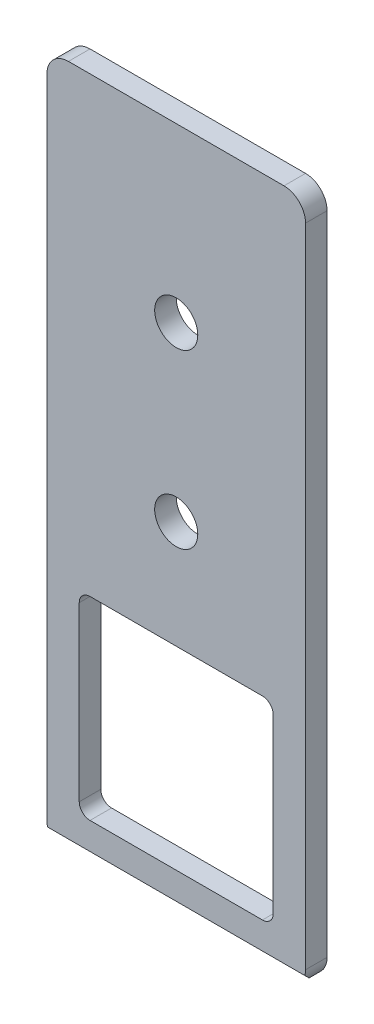
ISO-10303-21;
HEADER;
FILE_DESCRIPTION(('STEP AP214'),'2;1');
FILE_NAME('part.step','',(''),(''),'','','');
FILE_SCHEMA(('AUTOMOTIVE_DESIGN { 1 0 10303 214 1 1 1 1 }'));
ENDSEC;
DATA;
#1=APPLICATION_CONTEXT('core data for automotive mechanical design processes');
#2=APPLICATION_PROTOCOL_DEFINITION('international standard','automotive_design',2000,#1);
#3=PRODUCT_CONTEXT('',#1,'mechanical');
#4=PRODUCT('Part','Part','',(#3));
#5=PRODUCT_RELATED_PRODUCT_CATEGORY('part','',(#4));
#6=PRODUCT_DEFINITION_FORMATION('','',#4);
#7=PRODUCT_DEFINITION_CONTEXT('part definition',#1,'design');
#8=PRODUCT_DEFINITION('design','',#6,#7);
#9=PRODUCT_DEFINITION_SHAPE('','',#8);
#10=(LENGTH_UNIT() NAMED_UNIT(*) SI_UNIT(.MILLI.,.METRE.));
#11=(NAMED_UNIT(*) PLANE_ANGLE_UNIT() SI_UNIT($,.RADIAN.));
#12=(NAMED_UNIT(*) SI_UNIT($,.STERADIAN.) SOLID_ANGLE_UNIT());
#13=UNCERTAINTY_MEASURE_WITH_UNIT(LENGTH_MEASURE(1.E-05),#10,'distance_accuracy_value','');
#14=(GEOMETRIC_REPRESENTATION_CONTEXT(3) GLOBAL_UNCERTAINTY_ASSIGNED_CONTEXT((#13)) GLOBAL_UNIT_ASSIGNED_CONTEXT((#10,
#11,#12)) REPRESENTATION_CONTEXT('',''));
#15=CARTESIAN_POINT('',(0.,0.,0.));
#16=DIRECTION('',(0.,0.,1.));
#17=DIRECTION('',(1.,0.,0.));
#18=AXIS2_PLACEMENT_3D('',#15,#16,#17);
#19=CARTESIAN_POINT('',(3.175,98.425,3.175));
#20=DIRECTION('',(0.,0.,-1.));
#21=DIRECTION('',(-1.,0.,0.));
#22=AXIS2_PLACEMENT_3D('',#19,#20,#21);
#23=PLANE('',#22);
#24=CARTESIAN_POINT('',(19.05,76.2,3.175));
#25=DIRECTION('',(0.,0.,1.));
#26=DIRECTION('',(1.,0.,0.));
#27=AXIS2_PLACEMENT_3D('',#24,#25,#26);
#28=CIRCLE('',#27,3.175);
#29=CARTESIAN_POINT('',(22.225,76.2,3.175));
#30=VERTEX_POINT('',#29);
#31=EDGE_CURVE('E353',#30,#30,#28,.T.);
#32=ORIENTED_EDGE('',*,*,#31,.F.);
#33=EDGE_LOOP('',(#32));
#34=FACE_BOUND('',#33,.T.);
#35=CARTESIAN_POINT('',(19.05,50.8,3.175));
#36=DIRECTION('',(0.,0.,1.));
#37=DIRECTION('',(1.,0.,0.));
#38=AXIS2_PLACEMENT_3D('',#35,#36,#37);
#39=CIRCLE('',#38,3.175);
#40=CARTESIAN_POINT('',(22.225,50.8,3.175));
#41=VERTEX_POINT('',#40);
#42=EDGE_CURVE('E197',#41,#41,#39,.T.);
#43=ORIENTED_EDGE('',*,*,#42,.F.);
#44=EDGE_LOOP('',(#43));
#45=FACE_BOUND('',#44,.T.);
#46=CARTESIAN_POINT('',(3.175,3.175,3.175));
#47=DIRECTION('',(0.,0.,1.));
#48=DIRECTION('',(-1.,0.,0.));
#49=AXIS2_PLACEMENT_3D('',#46,#47,#48);
#50=CIRCLE('',#49,3.175);
#51=CARTESIAN_POINT('',(0.,3.17500000000002,3.175));
#52=VERTEX_POINT('',#51);
#53=CARTESIAN_POINT('',(0.100819468947863,2.38125,3.175));
#54=VERTEX_POINT('',#53);
#55=EDGE_CURVE('E168',#52,#54,#50,.T.);
#56=ORIENTED_EDGE('',*,*,#55,.T.);
#57=DIRECTION('',(-1.,0.,0.));
#58=VECTOR('',#57,1.);
#59=CARTESIAN_POINT('',(85.471,2.38125,3.175));
#60=LINE('',#59,#58);
#61=CARTESIAN_POINT('',(37.9991805310521,2.38125,3.175));
#62=VERTEX_POINT('',#61);
#63=EDGE_CURVE('E157',#62,#54,#60,.T.);
#64=ORIENTED_EDGE('',*,*,#63,.F.);
#65=CARTESIAN_POINT('',(34.925,3.175,3.175));
#66=DIRECTION('',(0.,0.,1.));
#67=DIRECTION('',(1.,0.,0.));
#68=AXIS2_PLACEMENT_3D('',#65,#66,#67);
#69=CIRCLE('',#68,3.175);
#70=CARTESIAN_POINT('',(38.1,3.175,3.175));
#71=VERTEX_POINT('',#70);
#72=EDGE_CURVE('E165',#62,#71,#69,.T.);
#73=ORIENTED_EDGE('',*,*,#72,.T.);
#74=DIRECTION('',(0.,1.,0.));
#75=VECTOR('',#74,1.);
#76=CARTESIAN_POINT('',(38.1,3.17500000000002,3.175));
#77=LINE('',#76,#75);
#78=CARTESIAN_POINT('',(38.1,98.425,3.175));
#79=VERTEX_POINT('',#78);
#80=EDGE_CURVE('E176',#71,#79,#77,.T.);
#81=ORIENTED_EDGE('',*,*,#80,.T.);
#82=CARTESIAN_POINT('',(34.925,98.425,3.175));
#83=DIRECTION('',(0.,0.,1.));
#84=DIRECTION('',(-1.,0.,0.));
#85=AXIS2_PLACEMENT_3D('',#82,#83,#84);
#86=CIRCLE('',#85,3.175);
#87=CARTESIAN_POINT('',(34.925,101.6,3.175));
#88=VERTEX_POINT('',#87);
#89=EDGE_CURVE('E180',#79,#88,#86,.T.);
#90=ORIENTED_EDGE('',*,*,#89,.T.);
#91=DIRECTION('',(-1.,0.,0.));
#92=VECTOR('',#91,1.);
#93=CARTESIAN_POINT('',(3.17500000000002,101.6,3.175));
#94=LINE('',#93,#92);
#95=CARTESIAN_POINT('',(3.17500000000002,101.6,3.175));
#96=VERTEX_POINT('',#95);
#97=EDGE_CURVE('E188',#88,#96,#94,.T.);
#98=ORIENTED_EDGE('',*,*,#97,.T.);
#99=CARTESIAN_POINT('',(3.175,98.425,3.175));
#100=DIRECTION('',(0.,0.,1.));
#101=DIRECTION('',(-1.,0.,0.));
#102=AXIS2_PLACEMENT_3D('',#99,#100,#101);
#103=CIRCLE('',#102,3.175);
#104=CARTESIAN_POINT('',(0.,98.425,3.175));
#105=VERTEX_POINT('',#104);
#106=EDGE_CURVE('E220',#96,#105,#103,.T.);
#107=ORIENTED_EDGE('',*,*,#106,.T.);
#108=DIRECTION('',(0.,-1.,0.));
#109=VECTOR('',#108,1.);
#110=CARTESIAN_POINT('',(0.,3.17500000000002,3.175));
#111=LINE('',#110,#109);
#112=EDGE_CURVE('E182',#105,#52,#111,.T.);
#113=ORIENTED_EDGE('',*,*,#112,.T.);
#114=EDGE_LOOP('',(#56,#64,#73,#81,#90,#98,#107,#113));
#115=FACE_BOUND('',#114,.T.);
#116=CARTESIAN_POINT('',(6.35,7.9375,3.175));
#117=DIRECTION('',(0.,0.,1.));
#118=DIRECTION('',(-1.,0.,0.));
#119=AXIS2_PLACEMENT_3D('',#116,#117,#118);
#120=CIRCLE('',#119,1.5875);
#121=CARTESIAN_POINT('',(4.7625,7.93750000000001,3.175));
#122=VERTEX_POINT('',#121);
#123=CARTESIAN_POINT('',(6.35000000000001,6.35,3.175));
#124=VERTEX_POINT('',#123);
#125=EDGE_CURVE('E276',#122,#124,#120,.T.);
#126=ORIENTED_EDGE('',*,*,#125,.F.);
#127=DIRECTION('',(0.,-1.,0.));
#128=VECTOR('',#127,1.);
#129=CARTESIAN_POINT('',(4.7625,7.93750000000001,3.175));
#130=LINE('',#129,#128);
#131=CARTESIAN_POINT('',(4.7625,33.3375,3.175));
#132=VERTEX_POINT('',#131);
#133=EDGE_CURVE('E298',#132,#122,#130,.T.);
#134=ORIENTED_EDGE('',*,*,#133,.F.);
#135=CARTESIAN_POINT('',(6.35,33.3375,3.175));
#136=DIRECTION('',(0.,0.,1.));
#137=DIRECTION('',(-1.,0.,0.));
#138=AXIS2_PLACEMENT_3D('',#135,#136,#137);
#139=CIRCLE('',#138,1.5875);
#140=CARTESIAN_POINT('',(6.35000000000001,34.925,3.175));
#141=VERTEX_POINT('',#140);
#142=EDGE_CURVE('E295',#141,#132,#139,.T.);
#143=ORIENTED_EDGE('',*,*,#142,.F.);
#144=DIRECTION('',(-1.,0.,0.));
#145=VECTOR('',#144,1.);
#146=CARTESIAN_POINT('',(6.35000000000001,34.925,3.175));
#147=LINE('',#146,#145);
#148=CARTESIAN_POINT('',(31.75,34.925,3.175));
#149=VERTEX_POINT('',#148);
#150=EDGE_CURVE('E292',#149,#141,#147,.T.);
#151=ORIENTED_EDGE('',*,*,#150,.F.);
#152=CARTESIAN_POINT('',(31.75,33.3375,3.175));
#153=DIRECTION('',(0.,0.,1.));
#154=DIRECTION('',(-1.,0.,0.));
#155=AXIS2_PLACEMENT_3D('',#152,#153,#154);
#156=CIRCLE('',#155,1.5875);
#157=CARTESIAN_POINT('',(33.3375,33.3375,3.175));
#158=VERTEX_POINT('',#157);
#159=EDGE_CURVE('E289',#158,#149,#156,.T.);
#160=ORIENTED_EDGE('',*,*,#159,.F.);
#161=DIRECTION('',(0.,1.,0.));
#162=VECTOR('',#161,1.);
#163=CARTESIAN_POINT('',(33.3375,7.93750000000001,3.175));
#164=LINE('',#163,#162);
#165=CARTESIAN_POINT('',(33.3375,7.9375,3.175));
#166=VERTEX_POINT('',#165);
#167=EDGE_CURVE('E286',#166,#158,#164,.T.);
#168=ORIENTED_EDGE('',*,*,#167,.F.);
#169=CARTESIAN_POINT('',(31.75,7.9375,3.175));
#170=DIRECTION('',(0.,0.,1.));
#171=DIRECTION('',(1.,0.,0.));
#172=AXIS2_PLACEMENT_3D('',#169,#170,#171);
#173=CIRCLE('',#172,1.5875);
#174=CARTESIAN_POINT('',(31.75,6.35,3.175));
#175=VERTEX_POINT('',#174);
#176=EDGE_CURVE('E283',#175,#166,#173,.T.);
#177=ORIENTED_EDGE('',*,*,#176,.F.);
#178=DIRECTION('',(1.,0.,0.));
#179=VECTOR('',#178,1.);
#180=CARTESIAN_POINT('',(6.35000000000001,6.35,3.175));
#181=LINE('',#180,#179);
#182=EDGE_CURVE('E279',#124,#175,#181,.T.);
#183=ORIENTED_EDGE('',*,*,#182,.F.);
#184=EDGE_LOOP('',(#126,#134,#143,#151,#160,#168,#177,#183));
#185=FACE_BOUND('',#184,.T.);
#186=ADVANCED_FACE('F39',(#34,#45,#115,#185),#23,.F.);
#187=CARTESIAN_POINT('',(3.175,98.425,0.));
#188=DIRECTION('',(0.,0.,-1.));
#189=DIRECTION('',(-1.,0.,0.));
#190=AXIS2_PLACEMENT_3D('',#187,#188,#189);
#191=PLANE('',#190);
#192=CARTESIAN_POINT('',(19.05,50.8,0.));
#193=DIRECTION('',(0.,0.,1.));
#194=DIRECTION('',(1.,0.,0.));
#195=AXIS2_PLACEMENT_3D('',#192,#193,#194);
#196=CIRCLE('',#195,3.175);
#197=CARTESIAN_POINT('',(22.225,50.8,0.));
#198=VERTEX_POINT('',#197);
#199=EDGE_CURVE('E357',#198,#198,#196,.T.);
#200=ORIENTED_EDGE('',*,*,#199,.T.);
#201=EDGE_LOOP('',(#200));
#202=FACE_BOUND('',#201,.T.);
#203=CARTESIAN_POINT('',(3.175,98.425,0.));
#204=DIRECTION('',(0.,0.,1.));
#205=DIRECTION('',(-1.,0.,0.));
#206=AXIS2_PLACEMENT_3D('',#203,#204,#205);
#207=CIRCLE('',#206,3.175);
#208=CARTESIAN_POINT('',(3.17500000000002,101.6,0.));
#209=VERTEX_POINT('',#208);
#210=CARTESIAN_POINT('',(0.,98.425,0.));
#211=VERTEX_POINT('',#210);
#212=EDGE_CURVE('E192',#209,#211,#207,.T.);
#213=ORIENTED_EDGE('',*,*,#212,.F.);
#214=DIRECTION('',(-1.,0.,0.));
#215=VECTOR('',#214,1.);
#216=CARTESIAN_POINT('',(3.17500000000002,101.6,0.));
#217=LINE('',#216,#215);
#218=CARTESIAN_POINT('',(34.925,101.6,0.));
#219=VERTEX_POINT('',#218);
#220=EDGE_CURVE('E217',#219,#209,#217,.T.);
#221=ORIENTED_EDGE('',*,*,#220,.F.);
#222=CARTESIAN_POINT('',(34.925,98.425,0.));
#223=DIRECTION('',(0.,0.,1.));
#224=DIRECTION('',(-1.,0.,0.));
#225=AXIS2_PLACEMENT_3D('',#222,#223,#224);
#226=CIRCLE('',#225,3.175);
#227=CARTESIAN_POINT('',(38.1,98.425,0.));
#228=VERTEX_POINT('',#227);
#229=EDGE_CURVE('E214',#228,#219,#226,.T.);
#230=ORIENTED_EDGE('',*,*,#229,.F.);
#231=DIRECTION('',(0.,1.,0.));
#232=VECTOR('',#231,1.);
#233=CARTESIAN_POINT('',(38.1,3.17500000000002,0.));
#234=LINE('',#233,#232);
#235=CARTESIAN_POINT('',(38.1,3.175,0.));
#236=VERTEX_POINT('',#235);
#237=EDGE_CURVE('E211',#236,#228,#234,.T.);
#238=ORIENTED_EDGE('',*,*,#237,.F.);
#239=CARTESIAN_POINT('',(34.925,3.175,0.));
#240=DIRECTION('',(0.,0.,1.));
#241=DIRECTION('',(1.,0.,0.));
#242=AXIS2_PLACEMENT_3D('',#239,#240,#241);
#243=CIRCLE('',#242,3.175);
#244=CARTESIAN_POINT('',(34.925,0.,0.));
#245=VERTEX_POINT('',#244);
#246=EDGE_CURVE('E208',#245,#236,#243,.T.);
#247=ORIENTED_EDGE('',*,*,#246,.F.);
#248=DIRECTION('',(1.,0.,0.));
#249=VECTOR('',#248,1.);
#250=CARTESIAN_POINT('',(3.17500000000002,0.,0.));
#251=LINE('',#250,#249);
#252=CARTESIAN_POINT('',(3.17500000000002,0.,0.));
#253=VERTEX_POINT('',#252);
#254=EDGE_CURVE('E204',#253,#245,#251,.T.);
#255=ORIENTED_EDGE('',*,*,#254,.F.);
#256=CARTESIAN_POINT('',(3.175,3.175,0.));
#257=DIRECTION('',(0.,0.,1.));
#258=DIRECTION('',(-1.,0.,0.));
#259=AXIS2_PLACEMENT_3D('',#256,#257,#258);
#260=CIRCLE('',#259,3.175);
#261=CARTESIAN_POINT('',(0.,3.17500000000002,0.));
#262=VERTEX_POINT('',#261);
#263=EDGE_CURVE('E200',#262,#253,#260,.T.);
#264=ORIENTED_EDGE('',*,*,#263,.F.);
#265=DIRECTION('',(0.,-1.,0.));
#266=VECTOR('',#265,1.);
#267=CARTESIAN_POINT('',(0.,3.17500000000002,0.));
#268=LINE('',#267,#266);
#269=EDGE_CURVE('E196',#211,#262,#268,.T.);
#270=ORIENTED_EDGE('',*,*,#269,.F.);
#271=EDGE_LOOP('',(#213,#221,#230,#238,#247,#255,#264,#270));
#272=FACE_BOUND('',#271,.T.);
#273=CARTESIAN_POINT('',(19.05,76.2,0.));
#274=DIRECTION('',(0.,0.,1.));
#275=DIRECTION('',(1.,0.,0.));
#276=AXIS2_PLACEMENT_3D('',#273,#274,#275);
#277=CIRCLE('',#276,3.175);
#278=CARTESIAN_POINT('',(22.225,76.2,0.));
#279=VERTEX_POINT('',#278);
#280=EDGE_CURVE('E352',#279,#279,#277,.T.);
#281=ORIENTED_EDGE('',*,*,#280,.T.);
#282=EDGE_LOOP('',(#281));
#283=FACE_BOUND('',#282,.T.);
#284=DIRECTION('',(0.,-1.,0.));
#285=VECTOR('',#284,1.);
#286=CARTESIAN_POINT('',(4.7625,7.93750000000001,0.));
#287=LINE('',#286,#285);
#288=CARTESIAN_POINT('',(4.7625,33.3375,0.));
#289=VERTEX_POINT('',#288);
#290=CARTESIAN_POINT('',(4.7625,7.93750000000001,0.));
#291=VERTEX_POINT('',#290);
#292=EDGE_CURVE('E280',#289,#291,#287,.T.);
#293=ORIENTED_EDGE('',*,*,#292,.T.);
#294=CARTESIAN_POINT('',(6.35,7.9375,0.));
#295=DIRECTION('',(0.,0.,1.));
#296=DIRECTION('',(-1.,0.,0.));
#297=AXIS2_PLACEMENT_3D('',#294,#295,#296);
#298=CIRCLE('',#297,1.5875);
#299=CARTESIAN_POINT('',(6.35000000000001,6.35,0.));
#300=VERTEX_POINT('',#299);
#301=EDGE_CURVE('E267',#291,#300,#298,.T.);
#302=ORIENTED_EDGE('',*,*,#301,.T.);
#303=DIRECTION('',(1.,0.,0.));
#304=VECTOR('',#303,1.);
#305=CARTESIAN_POINT('',(6.35000000000001,6.35,0.));
#306=LINE('',#305,#304);
#307=CARTESIAN_POINT('',(31.75,6.35,0.));
#308=VERTEX_POINT('',#307);
#309=EDGE_CURVE('E272',#300,#308,#306,.T.);
#310=ORIENTED_EDGE('',*,*,#309,.T.);
#311=CARTESIAN_POINT('',(31.75,7.9375,0.));
#312=DIRECTION('',(0.,0.,1.));
#313=DIRECTION('',(1.,0.,0.));
#314=AXIS2_PLACEMENT_3D('',#311,#312,#313);
#315=CIRCLE('',#314,1.5875);
#316=CARTESIAN_POINT('',(33.3375,7.9375,0.));
#317=VERTEX_POINT('',#316);
#318=EDGE_CURVE('E305',#308,#317,#315,.T.);
#319=ORIENTED_EDGE('',*,*,#318,.T.);
#320=DIRECTION('',(0.,1.,0.));
#321=VECTOR('',#320,1.);
#322=CARTESIAN_POINT('',(33.3375,7.93750000000001,0.));
#323=LINE('',#322,#321);
#324=CARTESIAN_POINT('',(33.3375,33.3375,0.));
#325=VERTEX_POINT('',#324);
#326=EDGE_CURVE('E309',#317,#325,#323,.T.);
#327=ORIENTED_EDGE('',*,*,#326,.T.);
#328=CARTESIAN_POINT('',(31.75,33.3375,0.));
#329=DIRECTION('',(0.,0.,1.));
#330=DIRECTION('',(-1.,0.,0.));
#331=AXIS2_PLACEMENT_3D('',#328,#329,#330);
#332=CIRCLE('',#331,1.5875);
#333=CARTESIAN_POINT('',(31.75,34.925,0.));
#334=VERTEX_POINT('',#333);
#335=EDGE_CURVE('E313',#325,#334,#332,.T.);
#336=ORIENTED_EDGE('',*,*,#335,.T.);
#337=DIRECTION('',(-1.,0.,0.));
#338=VECTOR('',#337,1.);
#339=CARTESIAN_POINT('',(6.35000000000001,34.925,0.));
#340=LINE('',#339,#338);
#341=CARTESIAN_POINT('',(6.35000000000001,34.925,0.));
#342=VERTEX_POINT('',#341);
#343=EDGE_CURVE('E317',#334,#342,#340,.T.);
#344=ORIENTED_EDGE('',*,*,#343,.T.);
#345=CARTESIAN_POINT('',(6.35,33.3375,0.));
#346=DIRECTION('',(0.,0.,1.));
#347=DIRECTION('',(-1.,0.,0.));
#348=AXIS2_PLACEMENT_3D('',#345,#346,#347);
#349=CIRCLE('',#348,1.5875);
#350=EDGE_CURVE('E321',#342,#289,#349,.T.);
#351=ORIENTED_EDGE('',*,*,#350,.T.);
#352=EDGE_LOOP('',(#293,#302,#310,#319,#327,#336,#344,#351));
#353=FACE_BOUND('',#352,.T.);
#354=ADVANCED_FACE('F256',(#202,#272,#283,#353),#191,.T.);
#355=CARTESIAN_POINT('',(3.175,98.425,3.175));
#356=DIRECTION('',(0.,0.,-1.));
#357=DIRECTION('',(-1.,0.,0.));
#358=AXIS2_PLACEMENT_3D('',#355,#356,#357);
#359=CYLINDRICAL_SURFACE('',#358,3.175);
#360=ORIENTED_EDGE('',*,*,#212,.T.);
#361=DIRECTION('',(0.,0.,-1.));
#362=VECTOR('',#361,1.);
#363=CARTESIAN_POINT('',(0.,98.425,3.175));
#364=LINE('',#363,#362);
#365=EDGE_CURVE('E48',#105,#211,#364,.T.);
#366=ORIENTED_EDGE('',*,*,#365,.F.);
#367=ORIENTED_EDGE('',*,*,#106,.F.);
#368=DIRECTION('',(0.,0.,-1.));
#369=VECTOR('',#368,1.);
#370=CARTESIAN_POINT('',(3.17500000000002,101.6,3.175));
#371=LINE('',#370,#369);
#372=EDGE_CURVE('E191',#96,#209,#371,.T.);
#373=ORIENTED_EDGE('',*,*,#372,.T.);
#374=EDGE_LOOP('',(#360,#366,#367,#373));
#375=FACE_BOUND('',#374,.T.);
#376=ADVANCED_FACE('F41',(#375),#359,.T.);
#377=CARTESIAN_POINT('',(0.,3.17500000000002,3.175));
#378=DIRECTION('',(1.,0.,0.));
#379=DIRECTION('',(0.,0.,-1.));
#380=AXIS2_PLACEMENT_3D('',#377,#378,#379);
#381=PLANE('',#380);
#382=ORIENTED_EDGE('',*,*,#269,.T.);
#383=DIRECTION('',(0.,0.,-1.));
#384=VECTOR('',#383,1.);
#385=CARTESIAN_POINT('',(0.,3.17500000000002,3.175));
#386=LINE('',#385,#384);
#387=EDGE_CURVE('E240',#52,#262,#386,.T.);
#388=ORIENTED_EDGE('',*,*,#387,.F.);
#389=ORIENTED_EDGE('',*,*,#112,.F.);
#390=ORIENTED_EDGE('',*,*,#365,.T.);
#391=EDGE_LOOP('',(#382,#388,#389,#390));
#392=FACE_BOUND('',#391,.T.);
#393=ADVANCED_FACE('F247',(#392),#381,.F.);
#394=CARTESIAN_POINT('',(3.175,3.175,3.175));
#395=DIRECTION('',(0.,0.,-1.));
#396=DIRECTION('',(-1.,0.,0.));
#397=AXIS2_PLACEMENT_3D('',#394,#395,#396);
#398=CYLINDRICAL_SURFACE('',#397,3.175);
#399=DIRECTION('',(0.,0.,-1.));
#400=VECTOR('',#399,1.);
#401=CARTESIAN_POINT('',(3.17500000000002,0.,3.175));
#402=LINE('',#401,#400);
#403=CARTESIAN_POINT('',(3.17500000000003,0.,0.793750000000007));
#404=VERTEX_POINT('',#403);
#405=EDGE_CURVE('E237',#404,#253,#402,.T.);
#406=ORIENTED_EDGE('',*,*,#405,.F.);
#407=CARTESIAN_POINT('',(3.175,3.175,3.96875));
#408=DIRECTION('',(0.,0.707106781186547,-0.707106781186549));
#409=DIRECTION('',(0.,-0.707106781186549,-0.707106781186547));
#410=AXIS2_PLACEMENT_3D('',#407,#408,#409);
#411=ELLIPSE('',#410,4.49012806053457,3.175);
#412=EDGE_CURVE('E265',#404,#54,#411,.T.);
#413=ORIENTED_EDGE('',*,*,#412,.T.);
#414=ORIENTED_EDGE('',*,*,#55,.F.);
#415=ORIENTED_EDGE('',*,*,#387,.T.);
#416=ORIENTED_EDGE('',*,*,#263,.T.);
#417=EDGE_LOOP('',(#406,#413,#414,#415,#416));
#418=FACE_BOUND('',#417,.T.);
#419=ADVANCED_FACE('F264',(#418),#398,.T.);
#420=CARTESIAN_POINT('',(3.17500000000002,0.,3.175));
#421=DIRECTION('',(0.,1.,0.));
#422=DIRECTION('',(0.,0.,1.));
#423=AXIS2_PLACEMENT_3D('',#420,#421,#422);
#424=PLANE('',#423);
#425=DIRECTION('',(0.,0.,-1.));
#426=VECTOR('',#425,1.);
#427=CARTESIAN_POINT('',(34.925,0.,3.175));
#428=LINE('',#427,#426);
#429=CARTESIAN_POINT('',(34.925,0.,0.793750000000007));
#430=VERTEX_POINT('',#429);
#431=EDGE_CURVE('E234',#430,#245,#428,.T.);
#432=ORIENTED_EDGE('',*,*,#431,.F.);
#433=DIRECTION('',(-1.,0.,0.));
#434=VECTOR('',#433,1.);
#435=CARTESIAN_POINT('',(85.471,0.,0.793750000000007));
#436=LINE('',#435,#434);
#437=EDGE_CURVE('E55',#430,#404,#436,.T.);
#438=ORIENTED_EDGE('',*,*,#437,.T.);
#439=ORIENTED_EDGE('',*,*,#405,.T.);
#440=ORIENTED_EDGE('',*,*,#254,.T.);
#441=EDGE_LOOP('',(#432,#438,#439,#440));
#442=FACE_BOUND('',#441,.T.);
#443=ADVANCED_FACE('F387',(#442),#424,.F.);
#444=CARTESIAN_POINT('',(34.925,3.175,3.175));
#445=DIRECTION('',(0.,0.,-1.));
#446=DIRECTION('',(-1.,0.,0.));
#447=AXIS2_PLACEMENT_3D('',#444,#445,#446);
#448=CYLINDRICAL_SURFACE('',#447,3.175);
#449=ORIENTED_EDGE('',*,*,#72,.F.);
#450=CARTESIAN_POINT('',(34.925,3.175,3.96875));
#451=DIRECTION('',(0.,0.707106781186547,-0.707106781186549));
#452=DIRECTION('',(0.,-0.707106781186549,-0.707106781186547));
#453=AXIS2_PLACEMENT_3D('',#450,#451,#452);
#454=ELLIPSE('',#453,4.49012806053457,3.175);
#455=EDGE_CURVE('E11',#62,#430,#454,.T.);
#456=ORIENTED_EDGE('',*,*,#455,.T.);
#457=ORIENTED_EDGE('',*,*,#431,.T.);
#458=ORIENTED_EDGE('',*,*,#246,.T.);
#459=DIRECTION('',(0.,0.,-1.));
#460=VECTOR('',#459,1.);
#461=CARTESIAN_POINT('',(38.1,3.175,3.175));
#462=LINE('',#461,#460);
#463=EDGE_CURVE('E173',#71,#236,#462,.T.);
#464=ORIENTED_EDGE('',*,*,#463,.F.);
#465=EDGE_LOOP('',(#449,#456,#457,#458,#464));
#466=FACE_BOUND('',#465,.T.);
#467=ADVANCED_FACE('F171',(#466),#448,.T.);
#468=CARTESIAN_POINT('',(38.1,3.17500000000002,3.175));
#469=DIRECTION('',(-1.,0.,0.));
#470=DIRECTION('',(0.,0.,1.));
#471=AXIS2_PLACEMENT_3D('',#468,#469,#470);
#472=PLANE('',#471);
#473=ORIENTED_EDGE('',*,*,#237,.T.);
#474=DIRECTION('',(0.,0.,-1.));
#475=VECTOR('',#474,1.);
#476=CARTESIAN_POINT('',(38.1,98.425,3.175));
#477=LINE('',#476,#475);
#478=EDGE_CURVE('E228',#79,#228,#477,.T.);
#479=ORIENTED_EDGE('',*,*,#478,.F.);
#480=ORIENTED_EDGE('',*,*,#80,.F.);
#481=ORIENTED_EDGE('',*,*,#463,.T.);
#482=EDGE_LOOP('',(#473,#479,#480,#481));
#483=FACE_BOUND('',#482,.T.);
#484=ADVANCED_FACE('F379',(#483),#472,.F.);
#485=CARTESIAN_POINT('',(34.925,98.425,3.175));
#486=DIRECTION('',(0.,0.,-1.));
#487=DIRECTION('',(-1.,0.,0.));
#488=AXIS2_PLACEMENT_3D('',#485,#486,#487);
#489=CYLINDRICAL_SURFACE('',#488,3.175);
#490=ORIENTED_EDGE('',*,*,#229,.T.);
#491=DIRECTION('',(0.,0.,-1.));
#492=VECTOR('',#491,1.);
#493=CARTESIAN_POINT('',(34.925,101.6,3.175));
#494=LINE('',#493,#492);
#495=EDGE_CURVE('E224',#88,#219,#494,.T.);
#496=ORIENTED_EDGE('',*,*,#495,.F.);
#497=ORIENTED_EDGE('',*,*,#89,.F.);
#498=ORIENTED_EDGE('',*,*,#478,.T.);
#499=EDGE_LOOP('',(#490,#496,#497,#498));
#500=FACE_BOUND('',#499,.T.);
#501=ADVANCED_FACE('F375',(#500),#489,.T.);
#502=CARTESIAN_POINT('',(3.17500000000002,101.6,3.175));
#503=DIRECTION('',(0.,-1.,0.));
#504=DIRECTION('',(0.,0.,-1.));
#505=AXIS2_PLACEMENT_3D('',#502,#503,#504);
#506=PLANE('',#505);
#507=ORIENTED_EDGE('',*,*,#220,.T.);
#508=ORIENTED_EDGE('',*,*,#372,.F.);
#509=ORIENTED_EDGE('',*,*,#97,.F.);
#510=ORIENTED_EDGE('',*,*,#495,.T.);
#511=EDGE_LOOP('',(#507,#508,#509,#510));
#512=FACE_BOUND('',#511,.T.);
#513=ADVANCED_FACE('F373',(#512),#506,.F.);
#514=CARTESIAN_POINT('',(19.05,50.8,3.175));
#515=DIRECTION('',(0.,0.,-1.));
#516=DIRECTION('',(-1.,0.,0.));
#517=AXIS2_PLACEMENT_3D('',#514,#515,#516);
#518=CYLINDRICAL_SURFACE('',#517,3.175);
#519=ORIENTED_EDGE('',*,*,#42,.T.);
#520=EDGE_LOOP('',(#519));
#521=FACE_BOUND('',#520,.T.);
#522=ORIENTED_EDGE('',*,*,#199,.F.);
#523=EDGE_LOOP('',(#522));
#524=FACE_BOUND('',#523,.T.);
#525=ADVANCED_FACE('F400',(#521,#524),#518,.F.);
#526=CARTESIAN_POINT('',(19.05,76.2,3.175));
#527=DIRECTION('',(0.,0.,-1.));
#528=DIRECTION('',(-1.,0.,0.));
#529=AXIS2_PLACEMENT_3D('',#526,#527,#528);
#530=CYLINDRICAL_SURFACE('',#529,3.175);
#531=ORIENTED_EDGE('',*,*,#31,.T.);
#532=EDGE_LOOP('',(#531));
#533=FACE_BOUND('',#532,.T.);
#534=ORIENTED_EDGE('',*,*,#280,.F.);
#535=EDGE_LOOP('',(#534));
#536=FACE_BOUND('',#535,.T.);
#537=ADVANCED_FACE('F407',(#533,#536),#530,.F.);
#538=CARTESIAN_POINT('',(6.35,7.9375,3.175));
#539=DIRECTION('',(0.,0.,-1.));
#540=DIRECTION('',(-1.,0.,0.));
#541=AXIS2_PLACEMENT_3D('',#538,#539,#540);
#542=CYLINDRICAL_SURFACE('',#541,1.5875);
#543=ORIENTED_EDGE('',*,*,#301,.F.);
#544=DIRECTION('',(0.,0.,-1.));
#545=VECTOR('',#544,1.);
#546=CARTESIAN_POINT('',(4.7625,7.93750000000001,3.175));
#547=LINE('',#546,#545);
#548=EDGE_CURVE('E300',#122,#291,#547,.T.);
#549=ORIENTED_EDGE('',*,*,#548,.F.);
#550=ORIENTED_EDGE('',*,*,#125,.T.);
#551=DIRECTION('',(0.,0.,-1.));
#552=VECTOR('',#551,1.);
#553=CARTESIAN_POINT('',(6.35000000000001,6.35,3.175));
#554=LINE('',#553,#552);
#555=EDGE_CURVE('E348',#124,#300,#554,.T.);
#556=ORIENTED_EDGE('',*,*,#555,.T.);
#557=EDGE_LOOP('',(#543,#549,#550,#556));
#558=FACE_BOUND('',#557,.T.);
#559=ADVANCED_FACE('F412',(#558),#542,.F.);
#560=CARTESIAN_POINT('',(6.35000000000001,6.35,3.175));
#561=DIRECTION('',(0.,1.,0.));
#562=DIRECTION('',(0.,0.,1.));
#563=AXIS2_PLACEMENT_3D('',#560,#561,#562);
#564=PLANE('',#563);
#565=ORIENTED_EDGE('',*,*,#309,.F.);
#566=ORIENTED_EDGE('',*,*,#555,.F.);
#567=ORIENTED_EDGE('',*,*,#182,.T.);
#568=DIRECTION('',(0.,0.,-1.));
#569=VECTOR('',#568,1.);
#570=CARTESIAN_POINT('',(31.75,6.35,3.175));
#571=LINE('',#570,#569);
#572=EDGE_CURVE('E345',#175,#308,#571,.T.);
#573=ORIENTED_EDGE('',*,*,#572,.T.);
#574=EDGE_LOOP('',(#565,#566,#567,#573));
#575=FACE_BOUND('',#574,.T.);
#576=ADVANCED_FACE('F420',(#575),#564,.T.);
#577=CARTESIAN_POINT('',(31.75,7.9375,3.175));
#578=DIRECTION('',(0.,0.,-1.));
#579=DIRECTION('',(-1.,0.,0.));
#580=AXIS2_PLACEMENT_3D('',#577,#578,#579);
#581=CYLINDRICAL_SURFACE('',#580,1.5875);
#582=ORIENTED_EDGE('',*,*,#318,.F.);
#583=ORIENTED_EDGE('',*,*,#572,.F.);
#584=ORIENTED_EDGE('',*,*,#176,.T.);
#585=DIRECTION('',(0.,0.,-1.));
#586=VECTOR('',#585,1.);
#587=CARTESIAN_POINT('',(33.3375,7.9375,3.175));
#588=LINE('',#587,#586);
#589=EDGE_CURVE('E342',#166,#317,#588,.T.);
#590=ORIENTED_EDGE('',*,*,#589,.T.);
#591=EDGE_LOOP('',(#582,#583,#584,#590));
#592=FACE_BOUND('',#591,.T.);
#593=ADVANCED_FACE('F427',(#592),#581,.F.);
#594=CARTESIAN_POINT('',(33.3375,7.93750000000001,3.175));
#595=DIRECTION('',(-1.,0.,0.));
#596=DIRECTION('',(0.,0.,1.));
#597=AXIS2_PLACEMENT_3D('',#594,#595,#596);
#598=PLANE('',#597);
#599=ORIENTED_EDGE('',*,*,#326,.F.);
#600=ORIENTED_EDGE('',*,*,#589,.F.);
#601=ORIENTED_EDGE('',*,*,#167,.T.);
#602=DIRECTION('',(0.,0.,-1.));
#603=VECTOR('',#602,1.);
#604=CARTESIAN_POINT('',(33.3375,33.3375,3.175));
#605=LINE('',#604,#603);
#606=EDGE_CURVE('E339',#158,#325,#605,.T.);
#607=ORIENTED_EDGE('',*,*,#606,.T.);
#608=EDGE_LOOP('',(#599,#600,#601,#607));
#609=FACE_BOUND('',#608,.T.);
#610=ADVANCED_FACE('F431',(#609),#598,.T.);
#611=CARTESIAN_POINT('',(31.75,33.3375,3.175));
#612=DIRECTION('',(0.,0.,-1.));
#613=DIRECTION('',(-1.,0.,0.));
#614=AXIS2_PLACEMENT_3D('',#611,#612,#613);
#615=CYLINDRICAL_SURFACE('',#614,1.5875);
#616=ORIENTED_EDGE('',*,*,#335,.F.);
#617=ORIENTED_EDGE('',*,*,#606,.F.);
#618=ORIENTED_EDGE('',*,*,#159,.T.);
#619=DIRECTION('',(0.,0.,-1.));
#620=VECTOR('',#619,1.);
#621=CARTESIAN_POINT('',(31.75,34.925,3.175));
#622=LINE('',#621,#620);
#623=EDGE_CURVE('E336',#149,#334,#622,.T.);
#624=ORIENTED_EDGE('',*,*,#623,.T.);
#625=EDGE_LOOP('',(#616,#617,#618,#624));
#626=FACE_BOUND('',#625,.T.);
#627=ADVANCED_FACE('F435',(#626),#615,.F.);
#628=CARTESIAN_POINT('',(6.35000000000001,34.925,3.175));
#629=DIRECTION('',(0.,-1.,0.));
#630=DIRECTION('',(0.,0.,-1.));
#631=AXIS2_PLACEMENT_3D('',#628,#629,#630);
#632=PLANE('',#631);
#633=ORIENTED_EDGE('',*,*,#343,.F.);
#634=ORIENTED_EDGE('',*,*,#623,.F.);
#635=ORIENTED_EDGE('',*,*,#150,.T.);
#636=DIRECTION('',(0.,0.,-1.));
#637=VECTOR('',#636,1.);
#638=CARTESIAN_POINT('',(6.35000000000001,34.925,3.175));
#639=LINE('',#638,#637);
#640=EDGE_CURVE('E333',#141,#342,#639,.T.);
#641=ORIENTED_EDGE('',*,*,#640,.T.);
#642=EDGE_LOOP('',(#633,#634,#635,#641));
#643=FACE_BOUND('',#642,.T.);
#644=ADVANCED_FACE('F439',(#643),#632,.T.);
#645=CARTESIAN_POINT('',(6.35,33.3375,3.175));
#646=DIRECTION('',(0.,0.,-1.));
#647=DIRECTION('',(-1.,0.,0.));
#648=AXIS2_PLACEMENT_3D('',#645,#646,#647);
#649=CYLINDRICAL_SURFACE('',#648,1.5875);
#650=ORIENTED_EDGE('',*,*,#350,.F.);
#651=ORIENTED_EDGE('',*,*,#640,.F.);
#652=ORIENTED_EDGE('',*,*,#142,.T.);
#653=DIRECTION('',(0.,0.,-1.));
#654=VECTOR('',#653,1.);
#655=CARTESIAN_POINT('',(4.7625,33.3375,3.175));
#656=LINE('',#655,#654);
#657=EDGE_CURVE('E62',#132,#289,#656,.T.);
#658=ORIENTED_EDGE('',*,*,#657,.T.);
#659=EDGE_LOOP('',(#650,#651,#652,#658));
#660=FACE_BOUND('',#659,.T.);
#661=ADVANCED_FACE('F443',(#660),#649,.F.);
#662=CARTESIAN_POINT('',(4.7625,7.93750000000001,3.175));
#663=DIRECTION('',(1.,0.,0.));
#664=DIRECTION('',(0.,0.,-1.));
#665=AXIS2_PLACEMENT_3D('',#662,#663,#664);
#666=PLANE('',#665);
#667=ORIENTED_EDGE('',*,*,#292,.F.);
#668=ORIENTED_EDGE('',*,*,#657,.F.);
#669=ORIENTED_EDGE('',*,*,#133,.T.);
#670=ORIENTED_EDGE('',*,*,#548,.T.);
#671=EDGE_LOOP('',(#667,#668,#669,#670));
#672=FACE_BOUND('',#671,.T.);
#673=ADVANCED_FACE('F447',(#672),#666,.T.);
#674=CARTESIAN_POINT('',(85.471,0.,0.793750000000007));
#675=DIRECTION('',(0.,0.707106781186547,-0.707106781186549));
#676=DIRECTION('',(0.,0.707106781186549,0.707106781186547));
#677=AXIS2_PLACEMENT_3D('',#674,#675,#676);
#678=PLANE('',#677);
#679=ORIENTED_EDGE('',*,*,#437,.F.);
#680=ORIENTED_EDGE('',*,*,#455,.F.);
#681=ORIENTED_EDGE('',*,*,#63,.T.);
#682=ORIENTED_EDGE('',*,*,#412,.F.);
#683=EDGE_LOOP('',(#679,#680,#681,#682));
#684=FACE_BOUND('',#683,.T.);
#685=ADVANCED_FACE('F156',(#684),#678,.F.);
#686=CLOSED_SHELL('',(#186,#354,#376,#393,#419,#443,#467,#484,#501,#513,#525,#537,#559,#576,
#593,#610,#627,#644,#661,#673,#685));
#687=MANIFOLD_SOLID_BREP('B2',#686);
#688=ADVANCED_BREP_SHAPE_REPRESENTATION('',(#18,#687),#14);
#689=SHAPE_DEFINITION_REPRESENTATION(#9,#688);
ENDSEC;
END-ISO-10303-21;
